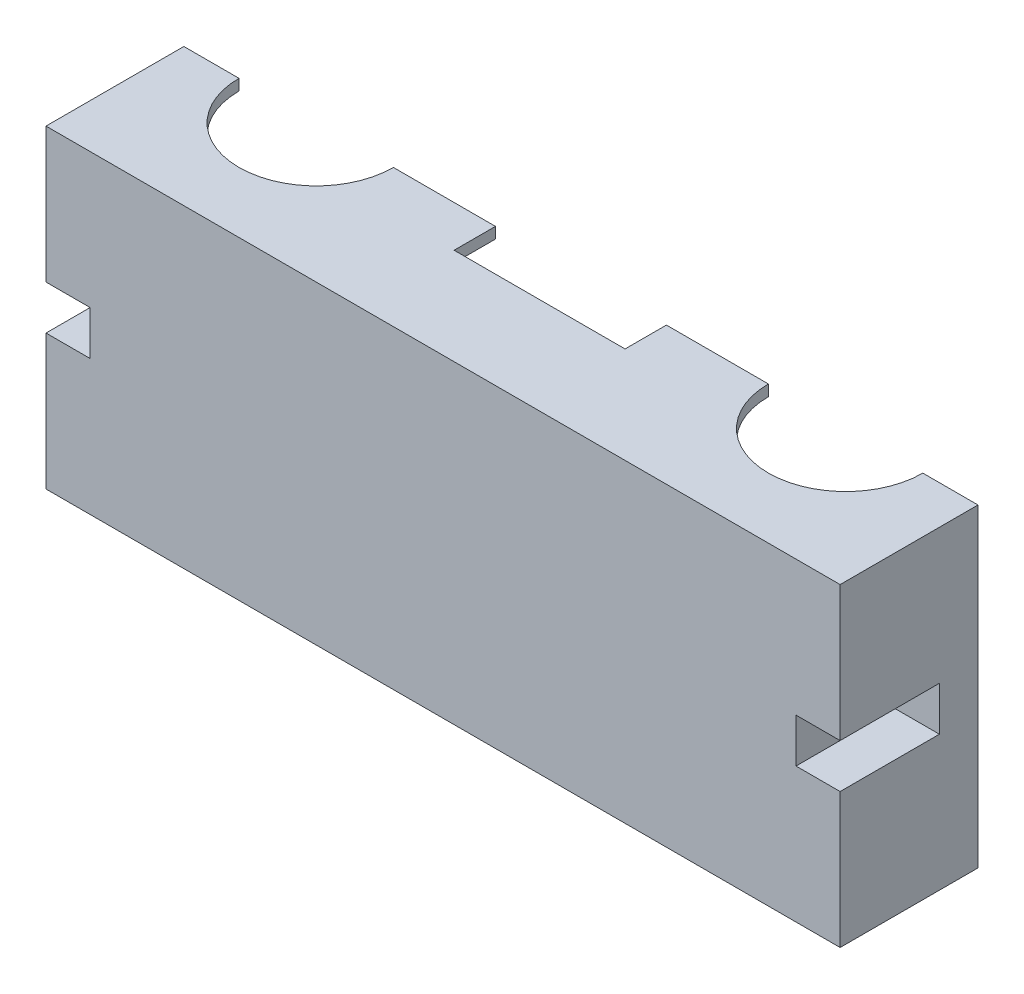
ISO-10303-21;
HEADER;
FILE_DESCRIPTION(('STEP AP214'),'2;1');
FILE_NAME('part.step','',(''),(''),'','','');
FILE_SCHEMA(('AUTOMOTIVE_DESIGN { 1 0 10303 214 1 1 1 1 }'));
ENDSEC;
DATA;
#1=APPLICATION_CONTEXT('core data for automotive mechanical design processes');
#2=APPLICATION_PROTOCOL_DEFINITION('international standard','automotive_design',2000,#1);
#3=PRODUCT_CONTEXT('',#1,'mechanical');
#4=PRODUCT('Part','Part','',(#3));
#5=PRODUCT_RELATED_PRODUCT_CATEGORY('part','',(#4));
#6=PRODUCT_DEFINITION_FORMATION('','',#4);
#7=PRODUCT_DEFINITION_CONTEXT('part definition',#1,'design');
#8=PRODUCT_DEFINITION('design','',#6,#7);
#9=PRODUCT_DEFINITION_SHAPE('','',#8);
#10=(LENGTH_UNIT() NAMED_UNIT(*) SI_UNIT(.MILLI.,.METRE.));
#11=(NAMED_UNIT(*) PLANE_ANGLE_UNIT() SI_UNIT($,.RADIAN.));
#12=(NAMED_UNIT(*) SI_UNIT($,.STERADIAN.) SOLID_ANGLE_UNIT());
#13=UNCERTAINTY_MEASURE_WITH_UNIT(LENGTH_MEASURE(1.E-05),#10,'distance_accuracy_value','');
#14=(GEOMETRIC_REPRESENTATION_CONTEXT(3) GLOBAL_UNCERTAINTY_ASSIGNED_CONTEXT((#13)) GLOBAL_UNIT_ASSIGNED_CONTEXT((#10,
#11,#12)) REPRESENTATION_CONTEXT('',''));
#15=CARTESIAN_POINT('',(0.,0.,0.));
#16=DIRECTION('',(0.,0.,1.));
#17=DIRECTION('',(1.,0.,0.));
#18=AXIS2_PLACEMENT_3D('',#15,#16,#17);
#19=CARTESIAN_POINT('',(0.,0.,0.));
#20=DIRECTION('',(0.,0.,-1.));
#21=DIRECTION('',(-1.,0.,0.));
#22=AXIS2_PLACEMENT_3D('',#19,#20,#21);
#23=PLANE('',#22);
#24=DIRECTION('',(0.,1.,0.));
#25=VECTOR('',#24,1.);
#26=CARTESIAN_POINT('',(3.04085171140608,27.4147727272727,0.));
#27=LINE('',#26,#25);
#28=CARTESIAN_POINT('',(3.04085171140608,27.4147727272727,0.));
#29=VERTEX_POINT('',#28);
#30=CARTESIAN_POINT('',(3.04085171140608,29.4147727272727,0.));
#31=VERTEX_POINT('',#30);
#32=EDGE_CURVE('E263',#29,#31,#27,.T.);
#33=ORIENTED_EDGE('',*,*,#32,.F.);
#34=DIRECTION('',(-1.,0.,0.));
#35=VECTOR('',#34,1.);
#36=CARTESIAN_POINT('',(0.,27.4147727272727,0.));
#37=LINE('',#36,#35);
#38=CARTESIAN_POINT('',(-15.4591482885939,27.4147727272727,0.));
#39=VERTEX_POINT('',#38);
#40=EDGE_CURVE('E257',#29,#39,#37,.T.);
#41=ORIENTED_EDGE('',*,*,#40,.T.);
#42=DIRECTION('',(0.,1.,0.));
#43=VECTOR('',#42,1.);
#44=CARTESIAN_POINT('',(-15.4591482885939,27.4147727272727,0.));
#45=LINE('',#44,#43);
#46=CARTESIAN_POINT('',(-15.4591482885939,29.4147727272727,0.));
#47=VERTEX_POINT('',#46);
#48=EDGE_CURVE('E241',#39,#47,#45,.T.);
#49=ORIENTED_EDGE('',*,*,#48,.T.);
#50=DIRECTION('',(-1.,0.,0.));
#51=VECTOR('',#50,1.);
#52=CARTESIAN_POINT('',(-102.959148288594,29.4147727272727,0.));
#53=LINE('',#52,#51);
#54=EDGE_CURVE('E407',#31,#47,#53,.T.);
#55=ORIENTED_EDGE('',*,*,#54,.F.);
#56=EDGE_LOOP('',(#33,#41,#49,#55));
#57=FACE_BOUND('',#56,.T.);
#58=ADVANCED_FACE('F33',(#57),#23,.T.);
#59=DIRECTION('',(0.,1.,0.));
#60=VECTOR('',#59,1.);
#61=CARTESIAN_POINT('',(31.0408517114061,27.4147727272727,0.));
#62=LINE('',#61,#60);
#63=CARTESIAN_POINT('',(31.0408517114061,29.4147727272727,0.));
#64=VERTEX_POINT('',#63);
#65=CARTESIAN_POINT('',(31.0408517114061,27.4147727272727,0.));
#66=VERTEX_POINT('',#65);
#67=EDGE_CURVE('E431',#64,#66,#62,.F.);
#68=ORIENTED_EDGE('',*,*,#67,.F.);
#69=CARTESIAN_POINT('',(41.0408517114061,29.4147727272727,0.));
#70=VERTEX_POINT('',#69);
#71=EDGE_CURVE('E404',#70,#64,#53,.T.);
#72=ORIENTED_EDGE('',*,*,#71,.F.);
#73=DIRECTION('',(0.,1.,0.));
#74=VECTOR('',#73,1.);
#75=CARTESIAN_POINT('',(41.0408517114061,-27.5852272727273,0.));
#76=LINE('',#75,#74);
#77=CARTESIAN_POINT('',(41.0408517114061,-27.5852272727273,0.));
#78=VERTEX_POINT('',#77);
#79=EDGE_CURVE('E401',#78,#70,#76,.T.);
#80=ORIENTED_EDGE('',*,*,#79,.F.);
#81=DIRECTION('',(1.,0.,0.));
#82=VECTOR('',#81,1.);
#83=CARTESIAN_POINT('',(-102.959148288594,-27.5852272727273,0.));
#84=LINE('',#83,#82);
#85=CARTESIAN_POINT('',(-102.959148288594,-27.5852272727273,0.));
#86=VERTEX_POINT('',#85);
#87=EDGE_CURVE('E399',#86,#78,#84,.T.);
#88=ORIENTED_EDGE('',*,*,#87,.F.);
#89=DIRECTION('',(0.,-1.,0.));
#90=VECTOR('',#89,1.);
#91=CARTESIAN_POINT('',(-102.959148288594,-27.5852272727273,0.));
#92=LINE('',#91,#90);
#93=CARTESIAN_POINT('',(-102.959148288594,29.4147727272727,0.));
#94=VERTEX_POINT('',#93);
#95=EDGE_CURVE('E352',#94,#86,#92,.T.);
#96=ORIENTED_EDGE('',*,*,#95,.F.);
#97=CARTESIAN_POINT('',(-92.9591482885939,29.4147727272727,0.));
#98=VERTEX_POINT('',#97);
#99=EDGE_CURVE('E403',#98,#94,#53,.T.);
#100=ORIENTED_EDGE('',*,*,#99,.F.);
#101=DIRECTION('',(0.,1.,0.));
#102=VECTOR('',#101,1.);
#103=CARTESIAN_POINT('',(-92.9591482885939,27.4147727272727,0.));
#104=LINE('',#103,#102);
#105=CARTESIAN_POINT('',(-92.9591482885939,27.4147727272727,0.));
#106=VERTEX_POINT('',#105);
#107=EDGE_CURVE('E420',#106,#98,#104,.T.);
#108=ORIENTED_EDGE('',*,*,#107,.F.);
#109=CARTESIAN_POINT('',(-100.959148288594,27.4147727272727,0.));
#110=VERTEX_POINT('',#109);
#111=EDGE_CURVE('E269',#106,#110,#37,.T.);
#112=ORIENTED_EDGE('',*,*,#111,.T.);
#113=DIRECTION('',(0.,-1.,0.));
#114=VECTOR('',#113,1.);
#115=CARTESIAN_POINT('',(-100.959148288594,0.,0.));
#116=LINE('',#115,#114);
#117=CARTESIAN_POINT('',(-100.959148288594,7.41477272727273,0.));
#118=VERTEX_POINT('',#117);
#119=EDGE_CURVE('E273',#110,#118,#116,.T.);
#120=ORIENTED_EDGE('',*,*,#119,.T.);
#121=DIRECTION('',(-1.,0.,0.));
#122=VECTOR('',#121,1.);
#123=CARTESIAN_POINT('',(0.,7.41477272727273,0.));
#124=LINE('',#123,#122);
#125=CARTESIAN_POINT('',(-93.4591482885939,7.41477272727273,0.));
#126=VERTEX_POINT('',#125);
#127=EDGE_CURVE('E281',#126,#118,#124,.T.);
#128=ORIENTED_EDGE('',*,*,#127,.F.);
#129=DIRECTION('',(0.,-1.,0.));
#130=VECTOR('',#129,1.);
#131=CARTESIAN_POINT('',(-93.4591482885939,0.,0.));
#132=LINE('',#131,#130);
#133=CARTESIAN_POINT('',(-93.4591482885939,-5.58522727272727,0.));
#134=VERTEX_POINT('',#133);
#135=EDGE_CURVE('E297',#126,#134,#132,.T.);
#136=ORIENTED_EDGE('',*,*,#135,.T.);
#137=DIRECTION('',(-1.,0.,0.));
#138=VECTOR('',#137,1.);
#139=CARTESIAN_POINT('',(0.,-5.58522727272727,0.));
#140=LINE('',#139,#138);
#141=CARTESIAN_POINT('',(-100.959148288594,-5.58522727272727,0.));
#142=VERTEX_POINT('',#141);
#143=EDGE_CURVE('E288',#134,#142,#140,.T.);
#144=ORIENTED_EDGE('',*,*,#143,.T.);
#145=DIRECTION('',(0.,-1.,0.));
#146=VECTOR('',#145,1.);
#147=CARTESIAN_POINT('',(-100.959148288594,0.,0.));
#148=LINE('',#147,#146);
#149=CARTESIAN_POINT('',(-100.959148288594,-25.5852272727273,0.));
#150=VERTEX_POINT('',#149);
#151=EDGE_CURVE('E294',#142,#150,#148,.T.);
#152=ORIENTED_EDGE('',*,*,#151,.T.);
#153=DIRECTION('',(-1.,0.,0.));
#154=VECTOR('',#153,1.);
#155=CARTESIAN_POINT('',(0.,-25.5852272727273,0.));
#156=LINE('',#155,#154);
#157=CARTESIAN_POINT('',(39.0408517114061,-25.5852272727273,0.));
#158=VERTEX_POINT('',#157);
#159=EDGE_CURVE('E291',#158,#150,#156,.T.);
#160=ORIENTED_EDGE('',*,*,#159,.F.);
#161=DIRECTION('',(0.,-1.,0.));
#162=VECTOR('',#161,1.);
#163=CARTESIAN_POINT('',(39.0408517114061,0.,0.));
#164=LINE('',#163,#162);
#165=CARTESIAN_POINT('',(39.0408517114061,-5.58522727272727,0.));
#166=VERTEX_POINT('',#165);
#167=EDGE_CURVE('E287',#166,#158,#164,.T.);
#168=ORIENTED_EDGE('',*,*,#167,.F.);
#169=CARTESIAN_POINT('',(31.5408517114061,-5.58522727272727,0.));
#170=VERTEX_POINT('',#169);
#171=EDGE_CURVE('E284',#166,#170,#140,.T.);
#172=ORIENTED_EDGE('',*,*,#171,.T.);
#173=DIRECTION('',(0.,-1.,0.));
#174=VECTOR('',#173,1.);
#175=CARTESIAN_POINT('',(31.5408517114061,0.,0.));
#176=LINE('',#175,#174);
#177=CARTESIAN_POINT('',(31.5408517114061,7.41477272727273,0.));
#178=VERTEX_POINT('',#177);
#179=EDGE_CURVE('E280',#178,#170,#176,.T.);
#180=ORIENTED_EDGE('',*,*,#179,.F.);
#181=CARTESIAN_POINT('',(39.0408517114061,7.41477272727273,0.));
#182=VERTEX_POINT('',#181);
#183=EDGE_CURVE('E277',#182,#178,#124,.T.);
#184=ORIENTED_EDGE('',*,*,#183,.F.);
#185=DIRECTION('',(0.,-1.,0.));
#186=VECTOR('',#185,1.);
#187=CARTESIAN_POINT('',(39.0408517114061,0.,0.));
#188=LINE('',#187,#186);
#189=CARTESIAN_POINT('',(39.0408517114061,27.4147727272727,0.));
#190=VERTEX_POINT('',#189);
#191=EDGE_CURVE('E268',#190,#182,#188,.T.);
#192=ORIENTED_EDGE('',*,*,#191,.F.);
#193=EDGE_CURVE('E264',#190,#66,#37,.T.);
#194=ORIENTED_EDGE('',*,*,#193,.T.);
#195=EDGE_LOOP('',(#68,#72,#80,#88,#96,#100,#108,#112,#120,#128,#136,#144,#152,#160,#168,#172,
#180,#184,#192,#194));
#196=FACE_BOUND('',#195,.T.);
#197=ADVANCED_FACE('F427',(#196),#23,.T.);
#198=DIRECTION('',(0.,1.,0.));
#199=VECTOR('',#198,1.);
#200=CARTESIAN_POINT('',(-64.9591482885939,27.4147727272727,0.));
#201=LINE('',#200,#199);
#202=CARTESIAN_POINT('',(-64.9591482885939,29.4147727272727,0.));
#203=VERTEX_POINT('',#202);
#204=CARTESIAN_POINT('',(-64.9591482885939,27.4147727272727,0.));
#205=VERTEX_POINT('',#204);
#206=EDGE_CURVE('E56',#203,#205,#201,.F.);
#207=ORIENTED_EDGE('',*,*,#206,.F.);
#208=CARTESIAN_POINT('',(-46.4591482885939,29.4147727272727,0.));
#209=VERTEX_POINT('',#208);
#210=EDGE_CURVE('E548',#209,#203,#53,.T.);
#211=ORIENTED_EDGE('',*,*,#210,.F.);
#212=DIRECTION('',(0.,1.,0.));
#213=VECTOR('',#212,1.);
#214=CARTESIAN_POINT('',(-46.4591482885939,27.4147727272727,0.));
#215=LINE('',#214,#213);
#216=CARTESIAN_POINT('',(-46.4591482885939,27.4147727272727,0.));
#217=VERTEX_POINT('',#216);
#218=EDGE_CURVE('E251',#217,#209,#215,.T.);
#219=ORIENTED_EDGE('',*,*,#218,.F.);
#220=EDGE_CURVE('E265',#217,#205,#37,.T.);
#221=ORIENTED_EDGE('',*,*,#220,.T.);
#222=EDGE_LOOP('',(#207,#211,#219,#221));
#223=FACE_BOUND('',#222,.T.);
#224=ADVANCED_FACE('F549',(#223),#23,.T.);
#225=CARTESIAN_POINT('',(-102.959148288594,-27.5852272727273,25.));
#226=DIRECTION('',(1.,0.,0.));
#227=DIRECTION('',(0.,0.,-1.));
#228=AXIS2_PLACEMENT_3D('',#225,#226,#227);
#229=PLANE('',#228);
#230=DIRECTION('',(0.,-1.,0.));
#231=VECTOR('',#230,1.);
#232=CARTESIAN_POINT('',(-102.959148288594,-27.5852272727273,25.));
#233=LINE('',#232,#231);
#234=CARTESIAN_POINT('',(-102.959148288594,-3.08522727272727,25.));
#235=VERTEX_POINT('',#234);
#236=CARTESIAN_POINT('',(-102.959148288594,-27.5852272727273,25.));
#237=VERTEX_POINT('',#236);
#238=EDGE_CURVE('E388',#235,#237,#233,.T.);
#239=ORIENTED_EDGE('',*,*,#238,.F.);
#240=DIRECTION('',(0.,0.,1.));
#241=VECTOR('',#240,1.);
#242=CARTESIAN_POINT('',(-102.959148288594,-3.08522727272727,7.));
#243=LINE('',#242,#241);
#244=CARTESIAN_POINT('',(-102.959148288594,-3.08522727272727,7.));
#245=VERTEX_POINT('',#244);
#246=EDGE_CURVE('E377',#245,#235,#243,.T.);
#247=ORIENTED_EDGE('',*,*,#246,.F.);
#248=DIRECTION('',(0.,-1.,0.));
#249=VECTOR('',#248,1.);
#250=CARTESIAN_POINT('',(-102.959148288594,4.91477272727273,7.));
#251=LINE('',#250,#249);
#252=CARTESIAN_POINT('',(-102.959148288594,4.91477272727273,7.));
#253=VERTEX_POINT('',#252);
#254=EDGE_CURVE('E365',#253,#245,#251,.T.);
#255=ORIENTED_EDGE('',*,*,#254,.F.);
#256=DIRECTION('',(0.,0.,1.));
#257=VECTOR('',#256,1.);
#258=CARTESIAN_POINT('',(-102.959148288594,4.91477272727273,7.));
#259=LINE('',#258,#257);
#260=CARTESIAN_POINT('',(-102.959148288594,4.91477272727273,25.));
#261=VERTEX_POINT('',#260);
#262=EDGE_CURVE('E379',#253,#261,#259,.T.);
#263=ORIENTED_EDGE('',*,*,#262,.T.);
#264=CARTESIAN_POINT('',(-102.959148288594,29.4147727272727,25.));
#265=VERTEX_POINT('',#264);
#266=EDGE_CURVE('E384',#265,#261,#233,.T.);
#267=ORIENTED_EDGE('',*,*,#266,.F.);
#268=DIRECTION('',(0.,0.,-1.));
#269=VECTOR('',#268,1.);
#270=CARTESIAN_POINT('',(-102.959148288594,29.4147727272727,25.));
#271=LINE('',#270,#269);
#272=EDGE_CURVE('E396',#265,#94,#271,.T.);
#273=ORIENTED_EDGE('',*,*,#272,.T.);
#274=ORIENTED_EDGE('',*,*,#95,.T.);
#275=DIRECTION('',(0.,0.,-1.));
#276=VECTOR('',#275,1.);
#277=CARTESIAN_POINT('',(-102.959148288594,-27.5852272727273,25.));
#278=LINE('',#277,#276);
#279=EDGE_CURVE('E416',#237,#86,#278,.T.);
#280=ORIENTED_EDGE('',*,*,#279,.F.);
#281=EDGE_LOOP('',(#239,#247,#255,#263,#267,#273,#274,#280));
#282=FACE_BOUND('',#281,.T.);
#283=ADVANCED_FACE('F35',(#282),#229,.F.);
#284=CARTESIAN_POINT('',(-102.959148288594,-27.5852272727273,25.));
#285=DIRECTION('',(0.,1.,0.));
#286=DIRECTION('',(0.,0.,1.));
#287=AXIS2_PLACEMENT_3D('',#284,#285,#286);
#288=PLANE('',#287);
#289=ORIENTED_EDGE('',*,*,#87,.T.);
#290=DIRECTION('',(0.,0.,-1.));
#291=VECTOR('',#290,1.);
#292=CARTESIAN_POINT('',(41.0408517114061,-27.5852272727273,25.));
#293=LINE('',#292,#291);
#294=CARTESIAN_POINT('',(41.0408517114061,-27.5852272727273,25.));
#295=VERTEX_POINT('',#294);
#296=EDGE_CURVE('E413',#295,#78,#293,.T.);
#297=ORIENTED_EDGE('',*,*,#296,.F.);
#298=DIRECTION('',(1.,0.,0.));
#299=VECTOR('',#298,1.);
#300=CARTESIAN_POINT('',(-102.959148288594,-27.5852272727273,25.));
#301=LINE('',#300,#299);
#302=EDGE_CURVE('E387',#237,#295,#301,.T.);
#303=ORIENTED_EDGE('',*,*,#302,.F.);
#304=ORIENTED_EDGE('',*,*,#279,.T.);
#305=EDGE_LOOP('',(#289,#297,#303,#304));
#306=FACE_BOUND('',#305,.T.);
#307=ADVANCED_FACE('F560',(#306),#288,.F.);
#308=CARTESIAN_POINT('',(41.0408517114061,-27.5852272727273,25.));
#309=DIRECTION('',(-1.,0.,0.));
#310=DIRECTION('',(0.,0.,1.));
#311=AXIS2_PLACEMENT_3D('',#308,#309,#310);
#312=PLANE('',#311);
#313=DIRECTION('',(0.,1.,0.));
#314=VECTOR('',#313,1.);
#315=CARTESIAN_POINT('',(41.0408517114061,4.91477272727273,7.));
#316=LINE('',#315,#314);
#317=CARTESIAN_POINT('',(41.0408517114061,-3.08522727272727,7.));
#318=VERTEX_POINT('',#317);
#319=CARTESIAN_POINT('',(41.0408517114061,4.91477272727273,7.));
#320=VERTEX_POINT('',#319);
#321=EDGE_CURVE('E327',#318,#320,#316,.T.);
#322=ORIENTED_EDGE('',*,*,#321,.F.);
#323=DIRECTION('',(0.,0.,1.));
#324=VECTOR('',#323,1.);
#325=CARTESIAN_POINT('',(41.0408517114061,-3.08522727272727,7.));
#326=LINE('',#325,#324);
#327=CARTESIAN_POINT('',(41.0408517114061,-3.08522727272727,25.));
#328=VERTEX_POINT('',#327);
#329=EDGE_CURVE('E349',#318,#328,#326,.T.);
#330=ORIENTED_EDGE('',*,*,#329,.T.);
#331=DIRECTION('',(0.,1.,0.));
#332=VECTOR('',#331,1.);
#333=CARTESIAN_POINT('',(41.0408517114061,-27.5852272727273,25.));
#334=LINE('',#333,#332);
#335=EDGE_CURVE('E391',#295,#328,#334,.T.);
#336=ORIENTED_EDGE('',*,*,#335,.F.);
#337=ORIENTED_EDGE('',*,*,#296,.T.);
#338=ORIENTED_EDGE('',*,*,#79,.T.);
#339=DIRECTION('',(0.,0.,-1.));
#340=VECTOR('',#339,1.);
#341=CARTESIAN_POINT('',(41.0408517114061,29.4147727272727,25.));
#342=LINE('',#341,#340);
#343=CARTESIAN_POINT('',(41.0408517114061,29.4147727272727,25.));
#344=VERTEX_POINT('',#343);
#345=EDGE_CURVE('E410',#344,#70,#342,.T.);
#346=ORIENTED_EDGE('',*,*,#345,.F.);
#347=CARTESIAN_POINT('',(41.0408517114061,4.91477272727272,25.));
#348=VERTEX_POINT('',#347);
#349=EDGE_CURVE('E390',#348,#344,#334,.T.);
#350=ORIENTED_EDGE('',*,*,#349,.F.);
#351=DIRECTION('',(0.,0.,1.));
#352=VECTOR('',#351,1.);
#353=CARTESIAN_POINT('',(41.0408517114061,4.91477272727273,7.));
#354=LINE('',#353,#352);
#355=EDGE_CURVE('E340',#320,#348,#354,.T.);
#356=ORIENTED_EDGE('',*,*,#355,.F.);
#357=EDGE_LOOP('',(#322,#330,#336,#337,#338,#346,#350,#356));
#358=FACE_BOUND('',#357,.T.);
#359=ADVANCED_FACE('F581',(#358),#312,.F.);
#360=CARTESIAN_POINT('',(-102.959148288594,29.4147727272727,25.));
#361=DIRECTION('',(0.,-1.,0.));
#362=DIRECTION('',(0.,0.,-1.));
#363=AXIS2_PLACEMENT_3D('',#360,#361,#362);
#364=PLANE('',#363);
#365=ORIENTED_EDGE('',*,*,#71,.T.);
#366=CARTESIAN_POINT('',(17.0408517114061,29.4147727272727,0.));
#367=DIRECTION('',(0.,1.,0.));
#368=DIRECTION('',(0.,0.,1.));
#369=AXIS2_PLACEMENT_3D('',#366,#367,#368);
#370=CIRCLE('',#369,14.);
#371=EDGE_CURVE('E520',#31,#64,#370,.T.);
#372=ORIENTED_EDGE('',*,*,#371,.F.);
#373=ORIENTED_EDGE('',*,*,#54,.T.);
#374=DIRECTION('',(0.,0.,-1.));
#375=VECTOR('',#374,1.);
#376=CARTESIAN_POINT('',(-15.4591482885939,29.4147727272727,0.));
#377=LINE('',#376,#375);
#378=CARTESIAN_POINT('',(-15.4591482885939,29.4147727272727,7.5));
#379=VERTEX_POINT('',#378);
#380=EDGE_CURVE('E246',#379,#47,#377,.T.);
#381=ORIENTED_EDGE('',*,*,#380,.F.);
#382=DIRECTION('',(1.,0.,0.));
#383=VECTOR('',#382,1.);
#384=CARTESIAN_POINT('',(-15.4591482885939,29.4147727272727,7.5));
#385=LINE('',#384,#383);
#386=CARTESIAN_POINT('',(-46.4591482885939,29.4147727272727,7.5));
#387=VERTEX_POINT('',#386);
#388=EDGE_CURVE('E260',#387,#379,#385,.T.);
#389=ORIENTED_EDGE('',*,*,#388,.F.);
#390=DIRECTION('',(0.,0.,1.));
#391=VECTOR('',#390,1.);
#392=CARTESIAN_POINT('',(-46.4591482885939,29.4147727272727,0.));
#393=LINE('',#392,#391);
#394=EDGE_CURVE('E531',#209,#387,#393,.T.);
#395=ORIENTED_EDGE('',*,*,#394,.F.);
#396=ORIENTED_EDGE('',*,*,#210,.T.);
#397=CARTESIAN_POINT('',(-78.9591482885939,29.4147727272727,0.));
#398=DIRECTION('',(0.,1.,0.));
#399=DIRECTION('',(0.,0.,1.));
#400=AXIS2_PLACEMENT_3D('',#397,#398,#399);
#401=CIRCLE('',#400,14.);
#402=EDGE_CURVE('E522',#98,#203,#401,.T.);
#403=ORIENTED_EDGE('',*,*,#402,.F.);
#404=ORIENTED_EDGE('',*,*,#99,.T.);
#405=ORIENTED_EDGE('',*,*,#272,.F.);
#406=DIRECTION('',(-1.,0.,0.));
#407=VECTOR('',#406,1.);
#408=CARTESIAN_POINT('',(-102.959148288594,29.4147727272727,25.));
#409=LINE('',#408,#407);
#410=EDGE_CURVE('E394',#344,#265,#409,.T.);
#411=ORIENTED_EDGE('',*,*,#410,.F.);
#412=ORIENTED_EDGE('',*,*,#345,.T.);
#413=EDGE_LOOP('',(#365,#372,#373,#381,#389,#395,#396,#403,#404,#405,#411,#412));
#414=FACE_BOUND('',#413,.T.);
#415=ADVANCED_FACE('F547',(#414),#364,.F.);
#416=CARTESIAN_POINT('',(0.,0.,25.));
#417=DIRECTION('',(0.,0.,-1.));
#418=DIRECTION('',(-1.,0.,0.));
#419=AXIS2_PLACEMENT_3D('',#416,#417,#418);
#420=PLANE('',#419);
#421=ORIENTED_EDGE('',*,*,#335,.T.);
#422=DIRECTION('',(1.,0.,0.));
#423=VECTOR('',#422,1.);
#424=CARTESIAN_POINT('',(41.0408517114061,-3.08522727272727,25.));
#425=LINE('',#424,#423);
#426=CARTESIAN_POINT('',(33.0408517114061,-3.08522727272727,25.));
#427=VERTEX_POINT('',#426);
#428=EDGE_CURVE('E331',#427,#328,#425,.T.);
#429=ORIENTED_EDGE('',*,*,#428,.F.);
#430=DIRECTION('',(0.,-1.,0.));
#431=VECTOR('',#430,1.);
#432=CARTESIAN_POINT('',(33.0408517114061,4.91477272727273,25.));
#433=LINE('',#432,#431);
#434=CARTESIAN_POINT('',(33.0408517114061,4.91477272727273,25.));
#435=VERTEX_POINT('',#434);
#436=EDGE_CURVE('E344',#435,#427,#433,.T.);
#437=ORIENTED_EDGE('',*,*,#436,.F.);
#438=DIRECTION('',(-1.,0.,0.));
#439=VECTOR('',#438,1.);
#440=CARTESIAN_POINT('',(41.0408517114061,4.91477272727273,25.));
#441=LINE('',#440,#439);
#442=EDGE_CURVE('E341',#348,#435,#441,.T.);
#443=ORIENTED_EDGE('',*,*,#442,.F.);
#444=ORIENTED_EDGE('',*,*,#349,.T.);
#445=ORIENTED_EDGE('',*,*,#410,.T.);
#446=ORIENTED_EDGE('',*,*,#266,.T.);
#447=DIRECTION('',(-1.,0.,0.));
#448=VECTOR('',#447,1.);
#449=CARTESIAN_POINT('',(-94.9591482885939,4.91477272727273,25.));
#450=LINE('',#449,#448);
#451=CARTESIAN_POINT('',(-94.9591482885939,4.91477272727273,25.));
#452=VERTEX_POINT('',#451);
#453=EDGE_CURVE('E372',#452,#261,#450,.T.);
#454=ORIENTED_EDGE('',*,*,#453,.F.);
#455=DIRECTION('',(0.,1.,0.));
#456=VECTOR('',#455,1.);
#457=CARTESIAN_POINT('',(-94.9591482885939,4.91477272727273,25.));
#458=LINE('',#457,#456);
#459=CARTESIAN_POINT('',(-94.9591482885939,-3.08522727272727,25.));
#460=VERTEX_POINT('',#459);
#461=EDGE_CURVE('E302',#460,#452,#458,.T.);
#462=ORIENTED_EDGE('',*,*,#461,.F.);
#463=DIRECTION('',(1.,0.,0.));
#464=VECTOR('',#463,1.);
#465=CARTESIAN_POINT('',(-94.9591482885939,-3.08522727272727,25.));
#466=LINE('',#465,#464);
#467=EDGE_CURVE('E362',#235,#460,#466,.T.);
#468=ORIENTED_EDGE('',*,*,#467,.F.);
#469=ORIENTED_EDGE('',*,*,#238,.T.);
#470=ORIENTED_EDGE('',*,*,#302,.T.);
#471=EDGE_LOOP('',(#421,#429,#437,#443,#444,#445,#446,#454,#462,#468,#469,#470));
#472=FACE_BOUND('',#471,.T.);
#473=ADVANCED_FACE('F565',(#472),#420,.F.);
#474=CARTESIAN_POINT('',(-94.9591482885939,4.91477272727273,7.));
#475=DIRECTION('',(1.,0.,0.));
#476=DIRECTION('',(0.,0.,-1.));
#477=AXIS2_PLACEMENT_3D('',#474,#475,#476);
#478=PLANE('',#477);
#479=ORIENTED_EDGE('',*,*,#461,.T.);
#480=DIRECTION('',(0.,0.,1.));
#481=VECTOR('',#480,1.);
#482=CARTESIAN_POINT('',(-94.9591482885939,4.91477272727273,7.));
#483=LINE('',#482,#481);
#484=CARTESIAN_POINT('',(-94.9591482885939,4.91477272727273,7.));
#485=VERTEX_POINT('',#484);
#486=EDGE_CURVE('E370',#485,#452,#483,.T.);
#487=ORIENTED_EDGE('',*,*,#486,.F.);
#488=DIRECTION('',(0.,1.,0.));
#489=VECTOR('',#488,1.);
#490=CARTESIAN_POINT('',(-94.9591482885939,4.91477272727273,7.));
#491=LINE('',#490,#489);
#492=CARTESIAN_POINT('',(-94.9591482885939,-3.08522727272727,7.));
#493=VERTEX_POINT('',#492);
#494=EDGE_CURVE('E358',#493,#485,#491,.T.);
#495=ORIENTED_EDGE('',*,*,#494,.F.);
#496=DIRECTION('',(0.,0.,1.));
#497=VECTOR('',#496,1.);
#498=CARTESIAN_POINT('',(-94.9591482885939,-3.08522727272727,7.));
#499=LINE('',#498,#497);
#500=EDGE_CURVE('E345',#493,#460,#499,.T.);
#501=ORIENTED_EDGE('',*,*,#500,.T.);
#502=EDGE_LOOP('',(#479,#487,#495,#501));
#503=FACE_BOUND('',#502,.T.);
#504=ADVANCED_FACE('F627',(#503),#478,.F.);
#505=CARTESIAN_POINT('',(-94.9591482885939,-3.08522727272727,7.));
#506=DIRECTION('',(0.,-1.,0.));
#507=DIRECTION('',(1.,0.,0.));
#508=AXIS2_PLACEMENT_3D('',#505,#506,#507);
#509=PLANE('',#508);
#510=ORIENTED_EDGE('',*,*,#467,.T.);
#511=ORIENTED_EDGE('',*,*,#500,.F.);
#512=DIRECTION('',(1.,0.,0.));
#513=VECTOR('',#512,1.);
#514=CARTESIAN_POINT('',(-94.9591482885939,-3.08522727272727,7.));
#515=LINE('',#514,#513);
#516=EDGE_CURVE('E367',#245,#493,#515,.T.);
#517=ORIENTED_EDGE('',*,*,#516,.F.);
#518=ORIENTED_EDGE('',*,*,#246,.T.);
#519=EDGE_LOOP('',(#510,#511,#517,#518));
#520=FACE_BOUND('',#519,.T.);
#521=ADVANCED_FACE('F569',(#520),#509,.F.);
#522=CARTESIAN_POINT('',(-94.9591482885939,4.91477272727273,7.));
#523=DIRECTION('',(0.,1.,0.));
#524=DIRECTION('',(-1.,0.,0.));
#525=AXIS2_PLACEMENT_3D('',#522,#523,#524);
#526=PLANE('',#525);
#527=ORIENTED_EDGE('',*,*,#453,.T.);
#528=ORIENTED_EDGE('',*,*,#262,.F.);
#529=DIRECTION('',(-1.,0.,0.));
#530=VECTOR('',#529,1.);
#531=CARTESIAN_POINT('',(-94.9591482885939,4.91477272727273,7.));
#532=LINE('',#531,#530);
#533=EDGE_CURVE('E361',#485,#253,#532,.T.);
#534=ORIENTED_EDGE('',*,*,#533,.F.);
#535=ORIENTED_EDGE('',*,*,#486,.T.);
#536=EDGE_LOOP('',(#527,#528,#534,#535));
#537=FACE_BOUND('',#536,.T.);
#538=ADVANCED_FACE('F634',(#537),#526,.F.);
#539=CARTESIAN_POINT('',(0.,0.,7.));
#540=DIRECTION('',(0.,0.,-1.));
#541=DIRECTION('',(-1.,0.,0.));
#542=AXIS2_PLACEMENT_3D('',#539,#540,#541);
#543=PLANE('',#542);
#544=ORIENTED_EDGE('',*,*,#494,.T.);
#545=ORIENTED_EDGE('',*,*,#533,.T.);
#546=ORIENTED_EDGE('',*,*,#254,.T.);
#547=ORIENTED_EDGE('',*,*,#516,.T.);
#548=EDGE_LOOP('',(#544,#545,#546,#547));
#549=FACE_BOUND('',#548,.T.);
#550=ADVANCED_FACE('F573',(#549),#543,.F.);
#551=CARTESIAN_POINT('',(41.0408517114061,-3.08522727272727,7.));
#552=DIRECTION('',(0.,-1.,0.));
#553=DIRECTION('',(1.,0.,0.));
#554=AXIS2_PLACEMENT_3D('',#551,#552,#553);
#555=PLANE('',#554);
#556=ORIENTED_EDGE('',*,*,#428,.T.);
#557=ORIENTED_EDGE('',*,*,#329,.F.);
#558=DIRECTION('',(1.,0.,0.));
#559=VECTOR('',#558,1.);
#560=CARTESIAN_POINT('',(41.0408517114061,-3.08522727272727,7.));
#561=LINE('',#560,#559);
#562=CARTESIAN_POINT('',(33.0408517114061,-3.08522727272727,7.));
#563=VERTEX_POINT('',#562);
#564=EDGE_CURVE('E337',#563,#318,#561,.T.);
#565=ORIENTED_EDGE('',*,*,#564,.F.);
#566=DIRECTION('',(0.,0.,1.));
#567=VECTOR('',#566,1.);
#568=CARTESIAN_POINT('',(33.0408517114061,-3.08522727272727,7.));
#569=LINE('',#568,#567);
#570=EDGE_CURVE('E353',#563,#427,#569,.T.);
#571=ORIENTED_EDGE('',*,*,#570,.T.);
#572=EDGE_LOOP('',(#556,#557,#565,#571));
#573=FACE_BOUND('',#572,.T.);
#574=ADVANCED_FACE('F587',(#573),#555,.F.);
#575=CARTESIAN_POINT('',(33.0408517114061,4.91477272727273,7.));
#576=DIRECTION('',(-1.,0.,0.));
#577=DIRECTION('',(0.,0.,1.));
#578=AXIS2_PLACEMENT_3D('',#575,#576,#577);
#579=PLANE('',#578);
#580=ORIENTED_EDGE('',*,*,#436,.T.);
#581=ORIENTED_EDGE('',*,*,#570,.F.);
#582=DIRECTION('',(0.,-1.,0.));
#583=VECTOR('',#582,1.);
#584=CARTESIAN_POINT('',(33.0408517114061,4.91477272727273,7.));
#585=LINE('',#584,#583);
#586=CARTESIAN_POINT('',(33.0408517114061,4.91477272727273,7.));
#587=VERTEX_POINT('',#586);
#588=EDGE_CURVE('E334',#587,#563,#585,.T.);
#589=ORIENTED_EDGE('',*,*,#588,.F.);
#590=DIRECTION('',(0.,0.,1.));
#591=VECTOR('',#590,1.);
#592=CARTESIAN_POINT('',(33.0408517114061,4.91477272727273,7.));
#593=LINE('',#592,#591);
#594=EDGE_CURVE('E355',#587,#435,#593,.T.);
#595=ORIENTED_EDGE('',*,*,#594,.T.);
#596=EDGE_LOOP('',(#580,#581,#589,#595));
#597=FACE_BOUND('',#596,.T.);
#598=ADVANCED_FACE('F591',(#597),#579,.F.);
#599=CARTESIAN_POINT('',(41.0408517114061,4.91477272727273,7.));
#600=DIRECTION('',(0.,1.,0.));
#601=DIRECTION('',(-1.,0.,0.));
#602=AXIS2_PLACEMENT_3D('',#599,#600,#601);
#603=PLANE('',#602);
#604=ORIENTED_EDGE('',*,*,#442,.T.);
#605=ORIENTED_EDGE('',*,*,#594,.F.);
#606=DIRECTION('',(-1.,0.,0.));
#607=VECTOR('',#606,1.);
#608=CARTESIAN_POINT('',(41.0408517114061,4.91477272727273,7.));
#609=LINE('',#608,#607);
#610=EDGE_CURVE('E330',#320,#587,#609,.T.);
#611=ORIENTED_EDGE('',*,*,#610,.F.);
#612=ORIENTED_EDGE('',*,*,#355,.T.);
#613=EDGE_LOOP('',(#604,#605,#611,#612));
#614=FACE_BOUND('',#613,.T.);
#615=ADVANCED_FACE('F593',(#614),#603,.F.);
#616=CARTESIAN_POINT('',(0.,0.,7.));
#617=DIRECTION('',(0.,0.,-1.));
#618=DIRECTION('',(-1.,0.,0.));
#619=AXIS2_PLACEMENT_3D('',#616,#617,#618);
#620=PLANE('',#619);
#621=ORIENTED_EDGE('',*,*,#321,.T.);
#622=ORIENTED_EDGE('',*,*,#610,.T.);
#623=ORIENTED_EDGE('',*,*,#588,.T.);
#624=ORIENTED_EDGE('',*,*,#564,.T.);
#625=EDGE_LOOP('',(#621,#622,#623,#624));
#626=FACE_BOUND('',#625,.T.);
#627=ADVANCED_FACE('F595',(#626),#620,.F.);
#628=CARTESIAN_POINT('',(-100.959148288594,0.,23.));
#629=DIRECTION('',(1.,0.,0.));
#630=DIRECTION('',(0.,0.,-1.));
#631=AXIS2_PLACEMENT_3D('',#628,#629,#630);
#632=PLANE('',#631);
#633=ORIENTED_EDGE('',*,*,#119,.F.);
#634=DIRECTION('',(0.,0.,-1.));
#635=VECTOR('',#634,1.);
#636=CARTESIAN_POINT('',(-100.959148288594,27.4147727272727,23.));
#637=LINE('',#636,#635);
#638=CARTESIAN_POINT('',(-100.959148288594,27.4147727272727,23.));
#639=VERTEX_POINT('',#638);
#640=EDGE_CURVE('E323',#639,#110,#637,.T.);
#641=ORIENTED_EDGE('',*,*,#640,.F.);
#642=DIRECTION('',(0.,-1.,0.));
#643=VECTOR('',#642,1.);
#644=CARTESIAN_POINT('',(-100.959148288594,0.,23.));
#645=LINE('',#644,#643);
#646=CARTESIAN_POINT('',(-100.959148288594,7.41477272727273,23.));
#647=VERTEX_POINT('',#646);
#648=EDGE_CURVE('E440',#639,#647,#645,.T.);
#649=ORIENTED_EDGE('',*,*,#648,.T.);
#650=DIRECTION('',(0.,0.,-1.));
#651=VECTOR('',#650,1.);
#652=CARTESIAN_POINT('',(-100.959148288594,7.41477272727273,23.));
#653=LINE('',#652,#651);
#654=EDGE_CURVE('E300',#647,#118,#653,.T.);
#655=ORIENTED_EDGE('',*,*,#654,.T.);
#656=EDGE_LOOP('',(#633,#641,#649,#655));
#657=FACE_BOUND('',#656,.T.);
#658=ADVANCED_FACE('F497',(#657),#632,.T.);
#659=CARTESIAN_POINT('',(0.,7.41477272727273,23.));
#660=DIRECTION('',(0.,-1.,0.));
#661=DIRECTION('',(0.,0.,-1.));
#662=AXIS2_PLACEMENT_3D('',#659,#660,#661);
#663=PLANE('',#662);
#664=ORIENTED_EDGE('',*,*,#127,.T.);
#665=ORIENTED_EDGE('',*,*,#654,.F.);
#666=DIRECTION('',(-1.,0.,0.));
#667=VECTOR('',#666,1.);
#668=CARTESIAN_POINT('',(0.,7.41477272727273,23.));
#669=LINE('',#668,#667);
#670=CARTESIAN_POINT('',(-93.4591482885939,7.41477272727273,23.));
#671=VERTEX_POINT('',#670);
#672=EDGE_CURVE('E326',#671,#647,#669,.T.);
#673=ORIENTED_EDGE('',*,*,#672,.F.);
#674=DIRECTION('',(0.,0.,-1.));
#675=VECTOR('',#674,1.);
#676=CARTESIAN_POINT('',(-93.4591482885939,7.41477272727273,23.));
#677=LINE('',#676,#675);
#678=EDGE_CURVE('E303',#671,#126,#677,.T.);
#679=ORIENTED_EDGE('',*,*,#678,.T.);
#680=EDGE_LOOP('',(#664,#665,#673,#679));
#681=FACE_BOUND('',#680,.T.);
#682=ADVANCED_FACE('F495',(#681),#663,.F.);
#683=CARTESIAN_POINT('',(-93.4591482885939,0.,23.));
#684=DIRECTION('',(1.,0.,0.));
#685=DIRECTION('',(0.,0.,-1.));
#686=AXIS2_PLACEMENT_3D('',#683,#684,#685);
#687=PLANE('',#686);
#688=ORIENTED_EDGE('',*,*,#135,.F.);
#689=ORIENTED_EDGE('',*,*,#678,.F.);
#690=DIRECTION('',(0.,-1.,0.));
#691=VECTOR('',#690,1.);
#692=CARTESIAN_POINT('',(-93.4591482885939,0.,23.));
#693=LINE('',#692,#691);
#694=CARTESIAN_POINT('',(-93.4591482885939,-5.58522727272727,23.));
#695=VERTEX_POINT('',#694);
#696=EDGE_CURVE('E463',#671,#695,#693,.T.);
#697=ORIENTED_EDGE('',*,*,#696,.T.);
#698=DIRECTION('',(0.,0.,-1.));
#699=VECTOR('',#698,1.);
#700=CARTESIAN_POINT('',(-93.4591482885939,-5.58522727272727,23.));
#701=LINE('',#700,#699);
#702=EDGE_CURVE('E305',#695,#134,#701,.T.);
#703=ORIENTED_EDGE('',*,*,#702,.T.);
#704=EDGE_LOOP('',(#688,#689,#697,#703));
#705=FACE_BOUND('',#704,.T.);
#706=ADVANCED_FACE('F491',(#705),#687,.T.);
#707=CARTESIAN_POINT('',(0.,-5.58522727272727,23.));
#708=DIRECTION('',(0.,-1.,0.));
#709=DIRECTION('',(0.,0.,-1.));
#710=AXIS2_PLACEMENT_3D('',#707,#708,#709);
#711=PLANE('',#710);
#712=ORIENTED_EDGE('',*,*,#143,.F.);
#713=ORIENTED_EDGE('',*,*,#702,.F.);
#714=DIRECTION('',(-1.,0.,0.));
#715=VECTOR('',#714,1.);
#716=CARTESIAN_POINT('',(0.,-5.58522727272727,23.));
#717=LINE('',#716,#715);
#718=CARTESIAN_POINT('',(-100.959148288594,-5.58522727272727,23.));
#719=VERTEX_POINT('',#718);
#720=EDGE_CURVE('E456',#695,#719,#717,.T.);
#721=ORIENTED_EDGE('',*,*,#720,.T.);
#722=DIRECTION('',(0.,0.,-1.));
#723=VECTOR('',#722,1.);
#724=CARTESIAN_POINT('',(-100.959148288594,-5.58522727272727,23.));
#725=LINE('',#724,#723);
#726=EDGE_CURVE('E307',#719,#142,#725,.T.);
#727=ORIENTED_EDGE('',*,*,#726,.T.);
#728=EDGE_LOOP('',(#712,#713,#721,#727));
#729=FACE_BOUND('',#728,.T.);
#730=ADVANCED_FACE('F472',(#729),#711,.T.);
#731=CARTESIAN_POINT('',(-100.959148288594,0.,23.));
#732=DIRECTION('',(1.,0.,0.));
#733=DIRECTION('',(0.,0.,-1.));
#734=AXIS2_PLACEMENT_3D('',#731,#732,#733);
#735=PLANE('',#734);
#736=ORIENTED_EDGE('',*,*,#151,.F.);
#737=ORIENTED_EDGE('',*,*,#726,.F.);
#738=DIRECTION('',(0.,-1.,0.));
#739=VECTOR('',#738,1.);
#740=CARTESIAN_POINT('',(-100.959148288594,0.,23.));
#741=LINE('',#740,#739);
#742=CARTESIAN_POINT('',(-100.959148288594,-25.5852272727273,23.));
#743=VERTEX_POINT('',#742);
#744=EDGE_CURVE('E462',#719,#743,#741,.T.);
#745=ORIENTED_EDGE('',*,*,#744,.T.);
#746=DIRECTION('',(0.,0.,-1.));
#747=VECTOR('',#746,1.);
#748=CARTESIAN_POINT('',(-100.959148288594,-25.5852272727273,23.));
#749=LINE('',#748,#747);
#750=EDGE_CURVE('E309',#743,#150,#749,.T.);
#751=ORIENTED_EDGE('',*,*,#750,.T.);
#752=EDGE_LOOP('',(#736,#737,#745,#751));
#753=FACE_BOUND('',#752,.T.);
#754=ADVANCED_FACE('F477',(#753),#735,.T.);
#755=CARTESIAN_POINT('',(0.,-25.5852272727273,23.));
#756=DIRECTION('',(0.,-1.,0.));
#757=DIRECTION('',(0.,0.,-1.));
#758=AXIS2_PLACEMENT_3D('',#755,#756,#757);
#759=PLANE('',#758);
#760=ORIENTED_EDGE('',*,*,#159,.T.);
#761=ORIENTED_EDGE('',*,*,#750,.F.);
#762=DIRECTION('',(-1.,0.,0.));
#763=VECTOR('',#762,1.);
#764=CARTESIAN_POINT('',(0.,-25.5852272727273,23.));
#765=LINE('',#764,#763);
#766=CARTESIAN_POINT('',(39.0408517114061,-25.5852272727273,23.));
#767=VERTEX_POINT('',#766);
#768=EDGE_CURVE('E459',#767,#743,#765,.T.);
#769=ORIENTED_EDGE('',*,*,#768,.F.);
#770=DIRECTION('',(0.,0.,-1.));
#771=VECTOR('',#770,1.);
#772=CARTESIAN_POINT('',(39.0408517114061,-25.5852272727273,23.));
#773=LINE('',#772,#771);
#774=EDGE_CURVE('E311',#767,#158,#773,.T.);
#775=ORIENTED_EDGE('',*,*,#774,.T.);
#776=EDGE_LOOP('',(#760,#761,#769,#775));
#777=FACE_BOUND('',#776,.T.);
#778=ADVANCED_FACE('F486',(#777),#759,.F.);
#779=CARTESIAN_POINT('',(39.0408517114061,0.,23.));
#780=DIRECTION('',(1.,0.,0.));
#781=DIRECTION('',(0.,0.,-1.));
#782=AXIS2_PLACEMENT_3D('',#779,#780,#781);
#783=PLANE('',#782);
#784=ORIENTED_EDGE('',*,*,#167,.T.);
#785=ORIENTED_EDGE('',*,*,#774,.F.);
#786=DIRECTION('',(0.,-1.,0.));
#787=VECTOR('',#786,1.);
#788=CARTESIAN_POINT('',(39.0408517114061,0.,23.));
#789=LINE('',#788,#787);
#790=CARTESIAN_POINT('',(39.0408517114061,-5.58522727272727,23.));
#791=VERTEX_POINT('',#790);
#792=EDGE_CURVE('E455',#791,#767,#789,.T.);
#793=ORIENTED_EDGE('',*,*,#792,.F.);
#794=DIRECTION('',(0.,0.,-1.));
#795=VECTOR('',#794,1.);
#796=CARTESIAN_POINT('',(39.0408517114061,-5.58522727272727,23.));
#797=LINE('',#796,#795);
#798=EDGE_CURVE('E313',#791,#166,#797,.T.);
#799=ORIENTED_EDGE('',*,*,#798,.T.);
#800=EDGE_LOOP('',(#784,#785,#793,#799));
#801=FACE_BOUND('',#800,.T.);
#802=ADVANCED_FACE('F517',(#801),#783,.F.);
#803=ORIENTED_EDGE('',*,*,#171,.F.);
#804=ORIENTED_EDGE('',*,*,#798,.F.);
#805=CARTESIAN_POINT('',(31.5408517114061,-5.58522727272727,23.));
#806=VERTEX_POINT('',#805);
#807=EDGE_CURVE('E453',#791,#806,#717,.T.);
#808=ORIENTED_EDGE('',*,*,#807,.T.);
#809=DIRECTION('',(0.,0.,-1.));
#810=VECTOR('',#809,1.);
#811=CARTESIAN_POINT('',(31.5408517114061,-5.58522727272727,23.));
#812=LINE('',#811,#810);
#813=EDGE_CURVE('E315',#806,#170,#812,.T.);
#814=ORIENTED_EDGE('',*,*,#813,.T.);
#815=EDGE_LOOP('',(#803,#804,#808,#814));
#816=FACE_BOUND('',#815,.T.);
#817=ADVANCED_FACE('F515',(#816),#711,.T.);
#818=CARTESIAN_POINT('',(31.5408517114061,0.,23.));
#819=DIRECTION('',(1.,0.,0.));
#820=DIRECTION('',(0.,0.,-1.));
#821=AXIS2_PLACEMENT_3D('',#818,#819,#820);
#822=PLANE('',#821);
#823=ORIENTED_EDGE('',*,*,#179,.T.);
#824=ORIENTED_EDGE('',*,*,#813,.F.);
#825=DIRECTION('',(0.,-1.,0.));
#826=VECTOR('',#825,1.);
#827=CARTESIAN_POINT('',(31.5408517114061,0.,23.));
#828=LINE('',#827,#826);
#829=CARTESIAN_POINT('',(31.5408517114061,7.41477272727273,23.));
#830=VERTEX_POINT('',#829);
#831=EDGE_CURVE('E450',#830,#806,#828,.T.);
#832=ORIENTED_EDGE('',*,*,#831,.F.);
#833=DIRECTION('',(0.,0.,-1.));
#834=VECTOR('',#833,1.);
#835=CARTESIAN_POINT('',(31.5408517114061,7.41477272727273,23.));
#836=LINE('',#835,#834);
#837=EDGE_CURVE('E317',#830,#178,#836,.T.);
#838=ORIENTED_EDGE('',*,*,#837,.T.);
#839=EDGE_LOOP('',(#823,#824,#832,#838));
#840=FACE_BOUND('',#839,.T.);
#841=ADVANCED_FACE('F511',(#840),#822,.F.);
#842=ORIENTED_EDGE('',*,*,#183,.T.);
#843=ORIENTED_EDGE('',*,*,#837,.F.);
#844=CARTESIAN_POINT('',(39.0408517114061,7.41477272727273,23.));
#845=VERTEX_POINT('',#844);
#846=EDGE_CURVE('E447',#845,#830,#669,.T.);
#847=ORIENTED_EDGE('',*,*,#846,.F.);
#848=DIRECTION('',(0.,0.,-1.));
#849=VECTOR('',#848,1.);
#850=CARTESIAN_POINT('',(39.0408517114061,7.41477272727273,23.));
#851=LINE('',#850,#849);
#852=EDGE_CURVE('E319',#845,#182,#851,.T.);
#853=ORIENTED_EDGE('',*,*,#852,.T.);
#854=EDGE_LOOP('',(#842,#843,#847,#853));
#855=FACE_BOUND('',#854,.T.);
#856=ADVANCED_FACE('F507',(#855),#663,.F.);
#857=CARTESIAN_POINT('',(39.0408517114061,0.,23.));
#858=DIRECTION('',(1.,0.,0.));
#859=DIRECTION('',(0.,0.,-1.));
#860=AXIS2_PLACEMENT_3D('',#857,#858,#859);
#861=PLANE('',#860);
#862=ORIENTED_EDGE('',*,*,#191,.T.);
#863=ORIENTED_EDGE('',*,*,#852,.F.);
#864=DIRECTION('',(0.,-1.,0.));
#865=VECTOR('',#864,1.);
#866=CARTESIAN_POINT('',(39.0408517114061,0.,23.));
#867=LINE('',#866,#865);
#868=CARTESIAN_POINT('',(39.0408517114061,27.4147727272727,23.));
#869=VERTEX_POINT('',#868);
#870=EDGE_CURVE('E444',#869,#845,#867,.T.);
#871=ORIENTED_EDGE('',*,*,#870,.F.);
#872=DIRECTION('',(0.,0.,-1.));
#873=VECTOR('',#872,1.);
#874=CARTESIAN_POINT('',(39.0408517114061,27.4147727272727,23.));
#875=LINE('',#874,#873);
#876=EDGE_CURVE('E321',#869,#190,#875,.T.);
#877=ORIENTED_EDGE('',*,*,#876,.T.);
#878=EDGE_LOOP('',(#862,#863,#871,#877));
#879=FACE_BOUND('',#878,.T.);
#880=ADVANCED_FACE('F501',(#879),#861,.F.);
#881=CARTESIAN_POINT('',(0.,27.4147727272727,23.));
#882=DIRECTION('',(0.,-1.,0.));
#883=DIRECTION('',(0.,0.,-1.));
#884=AXIS2_PLACEMENT_3D('',#881,#882,#883);
#885=PLANE('',#884);
#886=CARTESIAN_POINT('',(17.0408517114061,27.4147727272727,0.));
#887=DIRECTION('',(0.,-1.,0.));
#888=DIRECTION('',(0.,0.,-1.));
#889=AXIS2_PLACEMENT_3D('',#886,#887,#888);
#890=CIRCLE('',#889,14.);
#891=EDGE_CURVE('E11',#66,#29,#890,.T.);
#892=ORIENTED_EDGE('',*,*,#891,.F.);
#893=ORIENTED_EDGE('',*,*,#193,.F.);
#894=ORIENTED_EDGE('',*,*,#876,.F.);
#895=DIRECTION('',(-1.,0.,0.));
#896=VECTOR('',#895,1.);
#897=CARTESIAN_POINT('',(0.,27.4147727272727,23.));
#898=LINE('',#897,#896);
#899=EDGE_CURVE('E442',#869,#639,#898,.T.);
#900=ORIENTED_EDGE('',*,*,#899,.T.);
#901=ORIENTED_EDGE('',*,*,#640,.T.);
#902=ORIENTED_EDGE('',*,*,#111,.F.);
#903=CARTESIAN_POINT('',(-78.9591482885939,27.4147727272727,0.));
#904=DIRECTION('',(0.,-1.,0.));
#905=DIRECTION('',(0.,0.,-1.));
#906=AXIS2_PLACEMENT_3D('',#903,#904,#905);
#907=CIRCLE('',#906,14.);
#908=EDGE_CURVE('E41',#205,#106,#907,.T.);
#909=ORIENTED_EDGE('',*,*,#908,.F.);
#910=ORIENTED_EDGE('',*,*,#220,.F.);
#911=DIRECTION('',(0.,0.,1.));
#912=VECTOR('',#911,1.);
#913=CARTESIAN_POINT('',(-46.4591482885939,27.4147727272727,0.));
#914=LINE('',#913,#912);
#915=CARTESIAN_POINT('',(-46.4591482885939,27.4147727272727,7.5));
#916=VERTEX_POINT('',#915);
#917=EDGE_CURVE('E259',#217,#916,#914,.T.);
#918=ORIENTED_EDGE('',*,*,#917,.T.);
#919=DIRECTION('',(1.,0.,0.));
#920=VECTOR('',#919,1.);
#921=CARTESIAN_POINT('',(-15.4591482885939,27.4147727272727,7.5));
#922=LINE('',#921,#920);
#923=CARTESIAN_POINT('',(-15.4591482885939,27.4147727272727,7.5));
#924=VERTEX_POINT('',#923);
#925=EDGE_CURVE('E48',#916,#924,#922,.T.);
#926=ORIENTED_EDGE('',*,*,#925,.T.);
#927=DIRECTION('',(0.,0.,-1.));
#928=VECTOR('',#927,1.);
#929=CARTESIAN_POINT('',(-15.4591482885939,27.4147727272727,0.));
#930=LINE('',#929,#928);
#931=EDGE_CURVE('E244',#924,#39,#930,.T.);
#932=ORIENTED_EDGE('',*,*,#931,.T.);
#933=ORIENTED_EDGE('',*,*,#40,.F.);
#934=EDGE_LOOP('',(#892,#893,#894,#900,#901,#902,#909,#910,#918,#926,#932,#933));
#935=FACE_BOUND('',#934,.T.);
#936=ADVANCED_FACE('F256',(#935),#885,.T.);
#937=CARTESIAN_POINT('',(0.,0.,23.));
#938=DIRECTION('',(0.,0.,-1.));
#939=DIRECTION('',(-1.,0.,0.));
#940=AXIS2_PLACEMENT_3D('',#937,#938,#939);
#941=PLANE('',#940);
#942=ORIENTED_EDGE('',*,*,#648,.F.);
#943=ORIENTED_EDGE('',*,*,#899,.F.);
#944=ORIENTED_EDGE('',*,*,#870,.T.);
#945=ORIENTED_EDGE('',*,*,#846,.T.);
#946=ORIENTED_EDGE('',*,*,#831,.T.);
#947=ORIENTED_EDGE('',*,*,#807,.F.);
#948=ORIENTED_EDGE('',*,*,#792,.T.);
#949=ORIENTED_EDGE('',*,*,#768,.T.);
#950=ORIENTED_EDGE('',*,*,#744,.F.);
#951=ORIENTED_EDGE('',*,*,#720,.F.);
#952=ORIENTED_EDGE('',*,*,#696,.F.);
#953=ORIENTED_EDGE('',*,*,#672,.T.);
#954=EDGE_LOOP('',(#942,#943,#944,#945,#946,#947,#948,#949,#950,#951,#952,#953));
#955=FACE_BOUND('',#954,.T.);
#956=ADVANCED_FACE('F481',(#955),#941,.T.);
#957=CARTESIAN_POINT('',(-15.4591482885939,27.4147727272727,0.));
#958=DIRECTION('',(1.,0.,0.));
#959=DIRECTION('',(0.,0.,-1.));
#960=AXIS2_PLACEMENT_3D('',#957,#958,#959);
#961=PLANE('',#960);
#962=ORIENTED_EDGE('',*,*,#380,.T.);
#963=ORIENTED_EDGE('',*,*,#48,.F.);
#964=ORIENTED_EDGE('',*,*,#931,.F.);
#965=DIRECTION('',(0.,1.,0.));
#966=VECTOR('',#965,1.);
#967=CARTESIAN_POINT('',(-15.4591482885939,27.4147727272727,7.5));
#968=LINE('',#967,#966);
#969=EDGE_CURVE('E525',#924,#379,#968,.T.);
#970=ORIENTED_EDGE('',*,*,#969,.T.);
#971=EDGE_LOOP('',(#962,#963,#964,#970));
#972=FACE_BOUND('',#971,.T.);
#973=ADVANCED_FACE('F243',(#972),#961,.F.);
#974=CARTESIAN_POINT('',(-15.4591482885939,27.4147727272727,7.5));
#975=DIRECTION('',(0.,0.,1.));
#976=DIRECTION('',(1.,0.,0.));
#977=AXIS2_PLACEMENT_3D('',#974,#975,#976);
#978=PLANE('',#977);
#979=ORIENTED_EDGE('',*,*,#388,.T.);
#980=ORIENTED_EDGE('',*,*,#969,.F.);
#981=ORIENTED_EDGE('',*,*,#925,.F.);
#982=DIRECTION('',(0.,1.,0.));
#983=VECTOR('',#982,1.);
#984=CARTESIAN_POINT('',(-46.4591482885939,27.4147727272727,7.5));
#985=LINE('',#984,#983);
#986=EDGE_CURVE('E537',#916,#387,#985,.T.);
#987=ORIENTED_EDGE('',*,*,#986,.T.);
#988=EDGE_LOOP('',(#979,#980,#981,#987));
#989=FACE_BOUND('',#988,.T.);
#990=ADVANCED_FACE('F794',(#989),#978,.F.);
#991=CARTESIAN_POINT('',(-46.4591482885939,27.4147727272727,0.));
#992=DIRECTION('',(-1.,0.,0.));
#993=DIRECTION('',(0.,0.,1.));
#994=AXIS2_PLACEMENT_3D('',#991,#992,#993);
#995=PLANE('',#994);
#996=ORIENTED_EDGE('',*,*,#394,.T.);
#997=ORIENTED_EDGE('',*,*,#986,.F.);
#998=ORIENTED_EDGE('',*,*,#917,.F.);
#999=ORIENTED_EDGE('',*,*,#218,.T.);
#1000=EDGE_LOOP('',(#996,#997,#998,#999));
#1001=FACE_BOUND('',#1000,.T.);
#1002=ADVANCED_FACE('F542',(#1001),#995,.F.);
#1003=CARTESIAN_POINT('',(-78.9591482885939,27.4147727272727,0.));
#1004=DIRECTION('',(0.,1.,0.));
#1005=DIRECTION('',(0.,0.,1.));
#1006=AXIS2_PLACEMENT_3D('',#1003,#1004,#1005);
#1007=CYLINDRICAL_SURFACE('',#1006,14.);
#1008=ORIENTED_EDGE('',*,*,#107,.T.);
#1009=ORIENTED_EDGE('',*,*,#402,.T.);
#1010=ORIENTED_EDGE('',*,*,#206,.T.);
#1011=ORIENTED_EDGE('',*,*,#908,.T.);
#1012=EDGE_LOOP('',(#1008,#1009,#1010,#1011));
#1013=FACE_BOUND('',#1012,.T.);
#1014=ADVANCED_FACE('F419',(#1013),#1007,.F.);
#1015=CARTESIAN_POINT('',(17.0408517114061,27.4147727272727,0.));
#1016=DIRECTION('',(0.,1.,0.));
#1017=DIRECTION('',(0.,0.,1.));
#1018=AXIS2_PLACEMENT_3D('',#1015,#1016,#1017);
#1019=CYLINDRICAL_SURFACE('',#1018,14.);
#1020=ORIENTED_EDGE('',*,*,#32,.T.);
#1021=ORIENTED_EDGE('',*,*,#371,.T.);
#1022=ORIENTED_EDGE('',*,*,#67,.T.);
#1023=ORIENTED_EDGE('',*,*,#891,.T.);
#1024=EDGE_LOOP('',(#1020,#1021,#1022,#1023));
#1025=FACE_BOUND('',#1024,.T.);
#1026=ADVANCED_FACE('F519',(#1025),#1019,.F.);
#1027=CLOSED_SHELL('',(#58,#197,#224,#283,#307,#359,#415,#473,#504,#521,#538,#550,#574,#598,
#615,#627,#658,#682,#706,#730,#754,#778,#802,#817,#841,#856,#880,#936,#956,#973,#990,#1002,
#1014,#1026));
#1028=MANIFOLD_SOLID_BREP('B2',#1027);
#1029=ADVANCED_BREP_SHAPE_REPRESENTATION('',(#18,#1028),#14);
#1030=SHAPE_DEFINITION_REPRESENTATION(#9,#1029);
ENDSEC;
END-ISO-10303-21;
